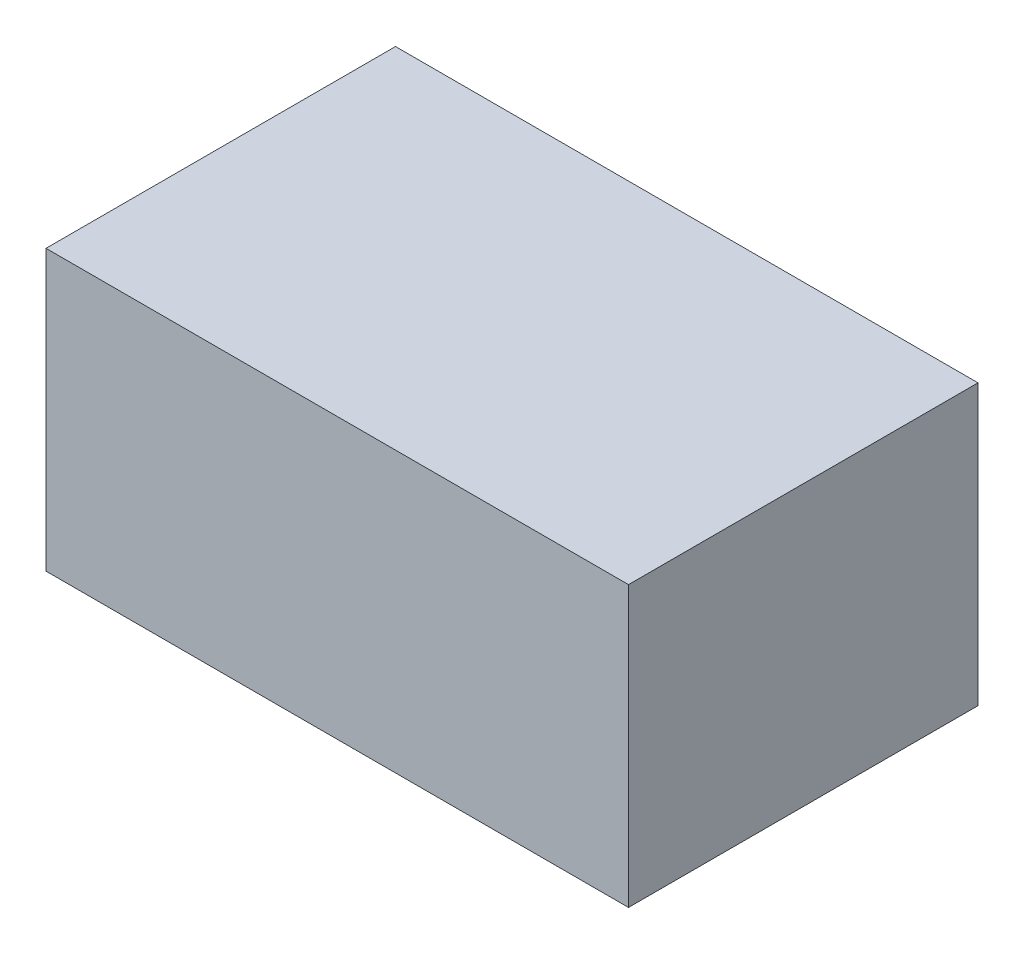
ISO-10303-21;
HEADER;
FILE_DESCRIPTION(('STEP AP214'),'2;1');
FILE_NAME('part.step','',(''),(''),'','','');
FILE_SCHEMA(('AUTOMOTIVE_DESIGN { 1 0 10303 214 1 1 1 1 }'));
ENDSEC;
DATA;
#1=APPLICATION_CONTEXT('core data for automotive mechanical design processes');
#2=APPLICATION_PROTOCOL_DEFINITION('international standard','automotive_design',2000,#1);
#3=PRODUCT_CONTEXT('',#1,'mechanical');
#4=PRODUCT('Part','Part','',(#3));
#5=PRODUCT_RELATED_PRODUCT_CATEGORY('part','',(#4));
#6=PRODUCT_DEFINITION_FORMATION('','',#4);
#7=PRODUCT_DEFINITION_CONTEXT('part definition',#1,'design');
#8=PRODUCT_DEFINITION('design','',#6,#7);
#9=PRODUCT_DEFINITION_SHAPE('','',#8);
#10=(LENGTH_UNIT() NAMED_UNIT(*) SI_UNIT(.MILLI.,.METRE.));
#11=(NAMED_UNIT(*) PLANE_ANGLE_UNIT() SI_UNIT($,.RADIAN.));
#12=(NAMED_UNIT(*) SI_UNIT($,.STERADIAN.) SOLID_ANGLE_UNIT());
#13=UNCERTAINTY_MEASURE_WITH_UNIT(LENGTH_MEASURE(1.E-05),#10,'distance_accuracy_value','');
#14=(GEOMETRIC_REPRESENTATION_CONTEXT(3) GLOBAL_UNCERTAINTY_ASSIGNED_CONTEXT((#13)) GLOBAL_UNIT_ASSIGNED_CONTEXT((#10,
#11,#12)) REPRESENTATION_CONTEXT('',''));
#15=CARTESIAN_POINT('',(0.,0.,0.));
#16=DIRECTION('',(0.,0.,1.));
#17=DIRECTION('',(1.,0.,0.));
#18=AXIS2_PLACEMENT_3D('',#15,#16,#17);
#19=CARTESIAN_POINT('',(-3.75000000000001,3.6,-2.25));
#20=DIRECTION('',(1.,0.,0.));
#21=DIRECTION('',(0.,0.,-1.));
#22=AXIS2_PLACEMENT_3D('',#19,#20,#21);
#23=PLANE('',#22);
#24=DIRECTION('',(0.,0.,1.));
#25=VECTOR('',#24,1.);
#26=CARTESIAN_POINT('',(-3.75000000000001,0.,-2.25));
#27=LINE('',#26,#25);
#28=CARTESIAN_POINT('',(-3.75000000000001,0.,-2.25));
#29=VERTEX_POINT('',#28);
#30=CARTESIAN_POINT('',(-3.75,0.,2.25));
#31=VERTEX_POINT('',#30);
#32=EDGE_CURVE('E96',#29,#31,#27,.T.);
#33=ORIENTED_EDGE('',*,*,#32,.T.);
#34=DIRECTION('',(0.,-1.,0.));
#35=VECTOR('',#34,1.);
#36=CARTESIAN_POINT('',(-3.75,3.6,2.25));
#37=LINE('',#36,#35);
#38=CARTESIAN_POINT('',(-3.75,3.6,2.25));
#39=VERTEX_POINT('',#38);
#40=EDGE_CURVE('E11',#39,#31,#37,.T.);
#41=ORIENTED_EDGE('',*,*,#40,.F.);
#42=DIRECTION('',(0.,0.,1.));
#43=VECTOR('',#42,1.);
#44=CARTESIAN_POINT('',(-3.75000000000001,3.6,-2.25));
#45=LINE('',#44,#43);
#46=CARTESIAN_POINT('',(-3.75000000000001,3.6,-2.25));
#47=VERTEX_POINT('',#46);
#48=EDGE_CURVE('E84',#47,#39,#45,.T.);
#49=ORIENTED_EDGE('',*,*,#48,.F.);
#50=DIRECTION('',(0.,-1.,0.));
#51=VECTOR('',#50,1.);
#52=CARTESIAN_POINT('',(-3.75000000000001,3.6,-2.25));
#53=LINE('',#52,#51);
#54=EDGE_CURVE('E92',#47,#29,#53,.T.);
#55=ORIENTED_EDGE('',*,*,#54,.T.);
#56=EDGE_LOOP('',(#33,#41,#49,#55));
#57=FACE_BOUND('',#56,.T.);
#58=ADVANCED_FACE('F33',(#57),#23,.F.);
#59=CARTESIAN_POINT('',(-3.75,3.6,2.25));
#60=DIRECTION('',(0.,0.,-1.));
#61=DIRECTION('',(-1.,0.,0.));
#62=AXIS2_PLACEMENT_3D('',#59,#60,#61);
#63=PLANE('',#62);
#64=DIRECTION('',(1.,0.,0.));
#65=VECTOR('',#64,1.);
#66=CARTESIAN_POINT('',(-3.75,0.,2.25));
#67=LINE('',#66,#65);
#68=CARTESIAN_POINT('',(3.75,0.,2.25));
#69=VERTEX_POINT('',#68);
#70=EDGE_CURVE('E88',#31,#69,#67,.T.);
#71=ORIENTED_EDGE('',*,*,#70,.T.);
#72=DIRECTION('',(0.,-1.,0.));
#73=VECTOR('',#72,1.);
#74=CARTESIAN_POINT('',(3.75,3.6,2.25));
#75=LINE('',#74,#73);
#76=CARTESIAN_POINT('',(3.75,3.6,2.25));
#77=VERTEX_POINT('',#76);
#78=EDGE_CURVE('E41',#77,#69,#75,.T.);
#79=ORIENTED_EDGE('',*,*,#78,.F.);
#80=DIRECTION('',(1.,0.,0.));
#81=VECTOR('',#80,1.);
#82=CARTESIAN_POINT('',(-3.75,3.6,2.25));
#83=LINE('',#82,#81);
#84=EDGE_CURVE('E79',#39,#77,#83,.T.);
#85=ORIENTED_EDGE('',*,*,#84,.F.);
#86=ORIENTED_EDGE('',*,*,#40,.T.);
#87=EDGE_LOOP('',(#71,#79,#85,#86));
#88=FACE_BOUND('',#87,.T.);
#89=ADVANCED_FACE('F87',(#88),#63,.F.);
#90=CARTESIAN_POINT('',(3.75,3.6,-2.25));
#91=DIRECTION('',(-1.,0.,0.));
#92=DIRECTION('',(0.,0.,1.));
#93=AXIS2_PLACEMENT_3D('',#90,#91,#92);
#94=PLANE('',#93);
#95=DIRECTION('',(0.,0.,-1.));
#96=VECTOR('',#95,1.);
#97=CARTESIAN_POINT('',(3.75,0.,-2.25));
#98=LINE('',#97,#96);
#99=CARTESIAN_POINT('',(3.75,0.,-2.25));
#100=VERTEX_POINT('',#99);
#101=EDGE_CURVE('E66',#69,#100,#98,.T.);
#102=ORIENTED_EDGE('',*,*,#101,.T.);
#103=DIRECTION('',(0.,-1.,0.));
#104=VECTOR('',#103,1.);
#105=CARTESIAN_POINT('',(3.75,3.6,-2.25));
#106=LINE('',#105,#104);
#107=CARTESIAN_POINT('',(3.75,3.6,-2.25));
#108=VERTEX_POINT('',#107);
#109=EDGE_CURVE('E89',#108,#100,#106,.T.);
#110=ORIENTED_EDGE('',*,*,#109,.F.);
#111=DIRECTION('',(0.,0.,-1.));
#112=VECTOR('',#111,1.);
#113=CARTESIAN_POINT('',(3.75,3.6,-2.25));
#114=LINE('',#113,#112);
#115=EDGE_CURVE('E82',#77,#108,#114,.T.);
#116=ORIENTED_EDGE('',*,*,#115,.F.);
#117=ORIENTED_EDGE('',*,*,#78,.T.);
#118=EDGE_LOOP('',(#102,#110,#116,#117));
#119=FACE_BOUND('',#118,.T.);
#120=ADVANCED_FACE('F90',(#119),#94,.F.);
#121=CARTESIAN_POINT('',(-3.75000000000001,3.6,-2.25));
#122=DIRECTION('',(0.,0.,1.));
#123=DIRECTION('',(1.,0.,0.));
#124=AXIS2_PLACEMENT_3D('',#121,#122,#123);
#125=PLANE('',#124);
#126=DIRECTION('',(-1.,0.,0.));
#127=VECTOR('',#126,1.);
#128=CARTESIAN_POINT('',(-3.75000000000001,0.,-2.25));
#129=LINE('',#128,#127);
#130=EDGE_CURVE('E72',#100,#29,#129,.T.);
#131=ORIENTED_EDGE('',*,*,#130,.T.);
#132=ORIENTED_EDGE('',*,*,#54,.F.);
#133=DIRECTION('',(-1.,0.,0.));
#134=VECTOR('',#133,1.);
#135=CARTESIAN_POINT('',(-3.75000000000001,3.6,-2.25));
#136=LINE('',#135,#134);
#137=EDGE_CURVE('E49',#108,#47,#136,.T.);
#138=ORIENTED_EDGE('',*,*,#137,.F.);
#139=ORIENTED_EDGE('',*,*,#109,.T.);
#140=EDGE_LOOP('',(#131,#132,#138,#139));
#141=FACE_BOUND('',#140,.T.);
#142=ADVANCED_FACE('F103',(#141),#125,.F.);
#143=CARTESIAN_POINT('',(0.,3.6,0.));
#144=DIRECTION('',(0.,1.,0.));
#145=DIRECTION('',(0.,0.,1.));
#146=AXIS2_PLACEMENT_3D('',#143,#144,#145);
#147=PLANE('',#146);
#148=ORIENTED_EDGE('',*,*,#48,.T.);
#149=ORIENTED_EDGE('',*,*,#84,.T.);
#150=ORIENTED_EDGE('',*,*,#115,.T.);
#151=ORIENTED_EDGE('',*,*,#137,.T.);
#152=EDGE_LOOP('',(#148,#149,#150,#151));
#153=FACE_BOUND('',#152,.T.);
#154=ADVANCED_FACE('F80',(#153),#147,.T.);
#155=CARTESIAN_POINT('',(0.,0.,0.));
#156=DIRECTION('',(0.,1.,0.));
#157=DIRECTION('',(0.,0.,1.));
#158=AXIS2_PLACEMENT_3D('',#155,#156,#157);
#159=PLANE('',#158);
#160=ORIENTED_EDGE('',*,*,#32,.F.);
#161=ORIENTED_EDGE('',*,*,#130,.F.);
#162=ORIENTED_EDGE('',*,*,#101,.F.);
#163=ORIENTED_EDGE('',*,*,#70,.F.);
#164=EDGE_LOOP('',(#160,#161,#162,#163));
#165=FACE_BOUND('',#164,.T.);
#166=ADVANCED_FACE('F106',(#165),#159,.F.);
#167=CLOSED_SHELL('',(#58,#89,#120,#142,#154,#166));
#168=MANIFOLD_SOLID_BREP('B2',#167);
#169=ADVANCED_BREP_SHAPE_REPRESENTATION('',(#18,#168),#14);
#170=SHAPE_DEFINITION_REPRESENTATION(#9,#169);
ENDSEC;
END-ISO-10303-21;
